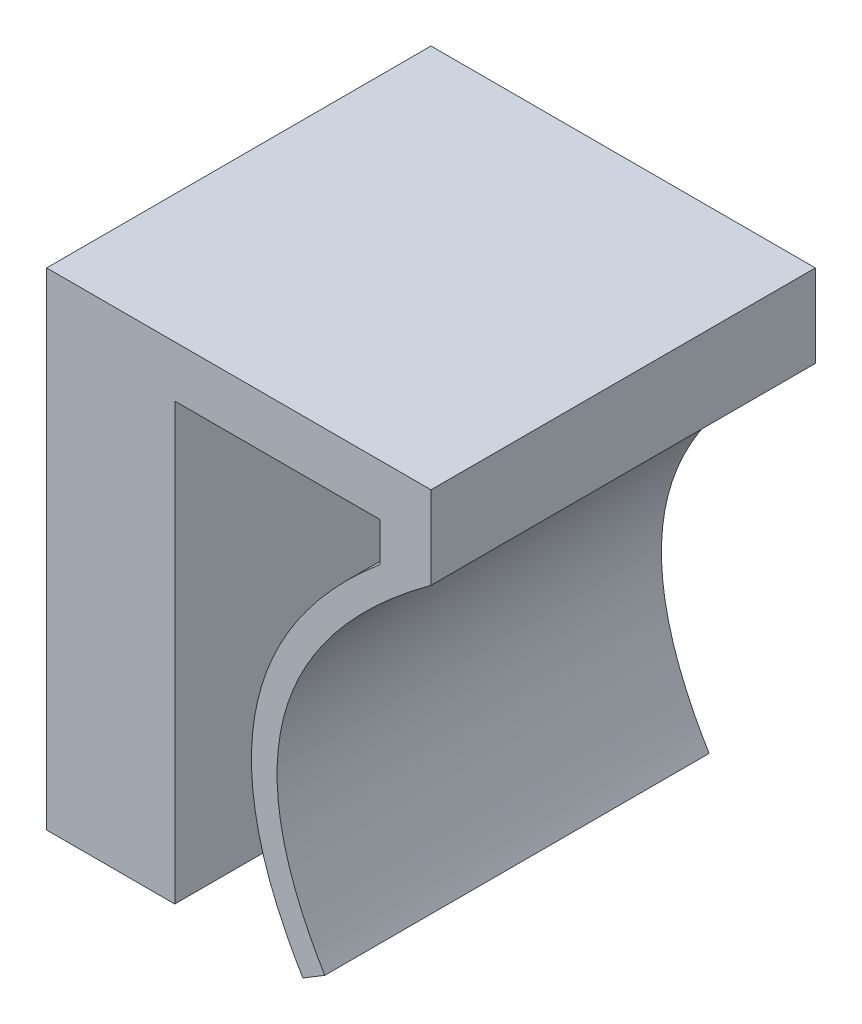
ISO-10303-21;
HEADER;
FILE_DESCRIPTION(('STEP AP214'),'2;1');
FILE_NAME('part.step','',(''),(''),'','','');
FILE_SCHEMA(('AUTOMOTIVE_DESIGN { 1 0 10303 214 1 1 1 1 }'));
ENDSEC;
DATA;
#1=APPLICATION_CONTEXT('core data for automotive mechanical design processes');
#2=APPLICATION_PROTOCOL_DEFINITION('international standard','automotive_design',2000,#1);
#3=PRODUCT_CONTEXT('',#1,'mechanical');
#4=PRODUCT('Part','Part','',(#3));
#5=PRODUCT_RELATED_PRODUCT_CATEGORY('part','',(#4));
#6=PRODUCT_DEFINITION_FORMATION('','',#4);
#7=PRODUCT_DEFINITION_CONTEXT('part definition',#1,'design');
#8=PRODUCT_DEFINITION('design','',#6,#7);
#9=PRODUCT_DEFINITION_SHAPE('','',#8);
#10=(LENGTH_UNIT() NAMED_UNIT(*) SI_UNIT(.MILLI.,.METRE.));
#11=(NAMED_UNIT(*) PLANE_ANGLE_UNIT() SI_UNIT($,.RADIAN.));
#12=(NAMED_UNIT(*) SI_UNIT($,.STERADIAN.) SOLID_ANGLE_UNIT());
#13=UNCERTAINTY_MEASURE_WITH_UNIT(LENGTH_MEASURE(1.E-05),#10,'distance_accuracy_value','');
#14=(GEOMETRIC_REPRESENTATION_CONTEXT(3) GLOBAL_UNCERTAINTY_ASSIGNED_CONTEXT((#13)) GLOBAL_UNIT_ASSIGNED_CONTEXT((#10,
#11,#12)) REPRESENTATION_CONTEXT('',''));
#15=CARTESIAN_POINT('',(0.,0.,0.));
#16=DIRECTION('',(0.,0.,1.));
#17=DIRECTION('',(1.,0.,0.));
#18=AXIS2_PLACEMENT_3D('',#15,#16,#17);
#19=CARTESIAN_POINT('',(9.00000000000061,7.35553860872421E-13,15.));
#20=DIRECTION('',(1.,0.,0.));
#21=DIRECTION('',(0.,1.,0.));
#22=AXIS2_PLACEMENT_3D('',#19,#20,#21);
#23=PLANE('',#22);
#24=DIRECTION('',(0.,-1.,0.));
#25=VECTOR('',#24,1.);
#26=CARTESIAN_POINT('',(9.00000000000061,7.35553860872421E-13,0.));
#27=LINE('',#26,#25);
#28=CARTESIAN_POINT('',(9.,7.5,0.));
#29=VERTEX_POINT('',#28);
#30=CARTESIAN_POINT('',(9.00000000000018,5.97176274610299,0.));
#31=VERTEX_POINT('',#30);
#32=EDGE_CURVE('E182',#29,#31,#27,.T.);
#33=ORIENTED_EDGE('',*,*,#32,.T.);
#34=DIRECTION('',(0.,0.,-1.));
#35=VECTOR('',#34,1.);
#36=CARTESIAN_POINT('',(9.00000000000018,5.97176274610299,15.));
#37=LINE('',#36,#35);
#38=CARTESIAN_POINT('',(9.00000000000018,5.97176274610299,15.));
#39=VERTEX_POINT('',#38);
#40=EDGE_CURVE('E44',#39,#31,#37,.T.);
#41=ORIENTED_EDGE('',*,*,#40,.F.);
#42=DIRECTION('',(0.,-1.,0.));
#43=VECTOR('',#42,1.);
#44=CARTESIAN_POINT('',(9.00000000000061,7.35553860872421E-13,15.));
#45=LINE('',#44,#43);
#46=CARTESIAN_POINT('',(9.,7.5,15.));
#47=VERTEX_POINT('',#46);
#48=EDGE_CURVE('E183',#47,#39,#45,.T.);
#49=ORIENTED_EDGE('',*,*,#48,.F.);
#50=DIRECTION('',(0.,0.,-1.));
#51=VECTOR('',#50,1.);
#52=CARTESIAN_POINT('',(9.,7.5,15.));
#53=LINE('',#52,#51);
#54=EDGE_CURVE('E231',#47,#29,#53,.T.);
#55=ORIENTED_EDGE('',*,*,#54,.T.);
#56=EDGE_LOOP('',(#33,#41,#49,#55));
#57=FACE_BOUND('',#56,.T.);
#58=ADVANCED_FACE('F36',(#57),#23,.F.);
#59=CARTESIAN_POINT('',(11.,7.5,15.));
#60=CARTESIAN_POINT('',(0.240697811936844,0.0167665630268218,15.));
#61=CARTESIAN_POINT('',(6.,-9.5,15.));
#62=B_SPLINE_CURVE_WITH_KNOTS('',2,(#59,#60,#61),.UNSPECIFIED.,.F.,.F.,(3,3),(0.,1.),.UNSPECIFIED.);
#63=DIRECTION('',(0.,0.,-1.));
#64=VECTOR('',#63,1.);
#65=SURFACE_OF_LINEAR_EXTRUSION('',#62,#64);
#66=CARTESIAN_POINT('',(11.,7.5,0.));
#67=CARTESIAN_POINT('',(0.240697811936844,0.0167665630268218,0.));
#68=CARTESIAN_POINT('',(6.,-9.5,0.));
#69=B_SPLINE_CURVE_WITH_KNOTS('',2,(#66,#67,#68),.UNSPECIFIED.,.F.,.F.,(3,3),(0.,1.),.UNSPECIFIED.);
#70=CARTESIAN_POINT('',(6.,-9.5,0.));
#71=VERTEX_POINT('',#70);
#72=EDGE_CURVE('E234',#31,#71,#69,.T.);
#73=ORIENTED_EDGE('',*,*,#72,.T.);
#74=DIRECTION('',(0.,0.,-1.));
#75=VECTOR('',#74,1.);
#76=CARTESIAN_POINT('',(6.,-9.5,15.));
#77=LINE('',#76,#75);
#78=CARTESIAN_POINT('',(6.,-9.5,15.));
#79=VERTEX_POINT('',#78);
#80=EDGE_CURVE('E278',#79,#71,#77,.T.);
#81=ORIENTED_EDGE('',*,*,#80,.F.);
#82=EDGE_CURVE('E186',#39,#79,#62,.T.);
#83=ORIENTED_EDGE('',*,*,#82,.F.);
#84=ORIENTED_EDGE('',*,*,#40,.T.);
#85=EDGE_LOOP('',(#73,#81,#83,#84));
#86=FACE_BOUND('',#85,.T.);
#87=ADVANCED_FACE('F197',(#86),#65,.F.);
#88=CARTESIAN_POINT('',(5.81639736848161,-9.61111158715883,15.));
#89=DIRECTION('',(0.517747016727039,-0.855533767112819,0.));
#90=DIRECTION('',(0.855533767112819,0.517747016727039,0.));
#91=AXIS2_PLACEMENT_3D('',#88,#89,#90);
#92=PLANE('',#91);
#93=DIRECTION('',(-0.855533767112819,-0.517747016727039,0.));
#94=VECTOR('',#93,1.);
#95=CARTESIAN_POINT('',(5.81639736848161,-9.61111158715883,0.));
#96=LINE('',#95,#94);
#97=CARTESIAN_POINT('',(6.85553376711282,-8.98225298327296,0.));
#98=VERTEX_POINT('',#97);
#99=EDGE_CURVE('E239',#98,#71,#96,.T.);
#100=ORIENTED_EDGE('',*,*,#99,.F.);
#101=DIRECTION('',(0.,0.,-1.));
#102=VECTOR('',#101,1.);
#103=CARTESIAN_POINT('',(6.85553376711282,-8.98225298327296,15.));
#104=LINE('',#103,#102);
#105=CARTESIAN_POINT('',(6.85553376711282,-8.98225298327296,15.));
#106=VERTEX_POINT('',#105);
#107=EDGE_CURVE('E276',#106,#98,#104,.T.);
#108=ORIENTED_EDGE('',*,*,#107,.F.);
#109=DIRECTION('',(-0.855533767112819,-0.517747016727039,0.));
#110=VECTOR('',#109,1.);
#111=CARTESIAN_POINT('',(5.81639736848161,-9.61111158715883,15.));
#112=LINE('',#111,#110);
#113=EDGE_CURVE('E192',#106,#79,#112,.T.);
#114=ORIENTED_EDGE('',*,*,#113,.T.);
#115=ORIENTED_EDGE('',*,*,#80,.T.);
#116=EDGE_LOOP('',(#100,#108,#114,#115));
#117=FACE_BOUND('',#116,.T.);
#118=ADVANCED_FACE('F200',(#117),#92,.T.);
#119=CARTESIAN_POINT('',(11.5708639442668,6.67921971086254,15.));
#120=CARTESIAN_POINT('',(11.1510322664102,6.38721490070189,15.));
#121=CARTESIAN_POINT('',(10.3072963332705,5.76628216768855,15.));
#122=CARTESIAN_POINT('',(8.84701885958429,4.54796863746397,15.));
#123=CARTESIAN_POINT('',(7.33459185275467,2.99484609067048,15.));
#124=CARTESIAN_POINT('',(6.04583115905915,1.11952073827862,15.));
#125=CARTESIAN_POINT('',(5.25144148934693,-0.76880077957946,15.));
#126=CARTESIAN_POINT('',(4.92610254372579,-2.68670336514474,15.));
#127=CARTESIAN_POINT('',(5.05697802427731,-4.67242782670206,15.));
#128=CARTESIAN_POINT('',(5.56480484112675,-6.41846130849039,15.));
#129=CARTESIAN_POINT('',(6.21321611618723,-7.85857634427404,15.));
#130=CARTESIAN_POINT('',(6.6357594951209,-8.61910283396404,15.));
#131=CARTESIAN_POINT('',(6.85553376711284,-8.98225298327293,15.));
#132=B_SPLINE_CURVE_WITH_KNOTS('',3,(#119,#120,#121,#122,#123,#124,#125,#126,#127,#128,#129,
#130,#131),.UNSPECIFIED.,.F.,.F.,(4,1,1,1,1,1,1,1,1,1,4),(0.,0.0625,0.125,0.25,0.375,0.5,0.625,
0.75,0.875,0.9375,1.),.UNSPECIFIED.);
#133=DIRECTION('',(0.,0.,-1.));
#134=VECTOR('',#133,1.);
#135=SURFACE_OF_LINEAR_EXTRUSION('',#132,#134);
#136=CARTESIAN_POINT('',(11.5708639442668,6.67921971086254,0.));
#137=CARTESIAN_POINT('',(11.1510322664102,6.38721490070189,0.));
#138=CARTESIAN_POINT('',(10.3072963332705,5.76628216768855,0.));
#139=CARTESIAN_POINT('',(8.84701885958429,4.54796863746397,0.));
#140=CARTESIAN_POINT('',(7.33459185275467,2.99484609067048,0.));
#141=CARTESIAN_POINT('',(6.04583115905915,1.11952073827862,0.));
#142=CARTESIAN_POINT('',(5.25144148934693,-0.76880077957946,0.));
#143=CARTESIAN_POINT('',(4.92610254372579,-2.68670336514474,0.));
#144=CARTESIAN_POINT('',(5.05697802427731,-4.67242782670206,0.));
#145=CARTESIAN_POINT('',(5.56480484112675,-6.41846130849039,0.));
#146=CARTESIAN_POINT('',(6.21321611618723,-7.85857634427404,0.));
#147=CARTESIAN_POINT('',(6.6357594951209,-8.61910283396404,0.));
#148=CARTESIAN_POINT('',(6.85553376711284,-8.98225298327293,0.));
#149=B_SPLINE_CURVE_WITH_KNOTS('',3,(#136,#137,#138,#139,#140,#141,#142,#143,#144,#145,#146,
#147,#148),.UNSPECIFIED.,.F.,.F.,(4,1,1,1,1,1,1,1,1,1,4),(0.,0.0625,0.125,0.25,0.375,0.5,0.625,
0.75,0.875,0.9375,1.),.UNSPECIFIED.);
#150=CARTESIAN_POINT('',(11.,6.27162607439287,0.));
#151=VERTEX_POINT('',#150);
#152=EDGE_CURVE('E245',#151,#98,#149,.T.);
#153=ORIENTED_EDGE('',*,*,#152,.F.);
#154=DIRECTION('',(0.,0.,-1.));
#155=VECTOR('',#154,1.);
#156=CARTESIAN_POINT('',(11.,6.27162607439287,15.));
#157=LINE('',#156,#155);
#158=CARTESIAN_POINT('',(11.,6.27162607439287,15.));
#159=VERTEX_POINT('',#158);
#160=EDGE_CURVE('E274',#159,#151,#157,.T.);
#161=ORIENTED_EDGE('',*,*,#160,.F.);
#162=EDGE_CURVE('E211',#159,#106,#132,.T.);
#163=ORIENTED_EDGE('',*,*,#162,.T.);
#164=ORIENTED_EDGE('',*,*,#107,.T.);
#165=EDGE_LOOP('',(#153,#161,#163,#164));
#166=FACE_BOUND('',#165,.T.);
#167=ADVANCED_FACE('F204',(#166),#135,.T.);
#168=CARTESIAN_POINT('',(11.,0.,15.));
#169=DIRECTION('',(1.,0.,0.));
#170=DIRECTION('',(0.,1.,0.));
#171=AXIS2_PLACEMENT_3D('',#168,#169,#170);
#172=PLANE('',#171);
#173=DIRECTION('',(0.,-1.,0.));
#174=VECTOR('',#173,1.);
#175=CARTESIAN_POINT('',(11.,0.,0.));
#176=LINE('',#175,#174);
#177=CARTESIAN_POINT('',(11.,9.5,0.));
#178=VERTEX_POINT('',#177);
#179=EDGE_CURVE('E250',#178,#151,#176,.T.);
#180=ORIENTED_EDGE('',*,*,#179,.F.);
#181=DIRECTION('',(0.,0.,-1.));
#182=VECTOR('',#181,1.);
#183=CARTESIAN_POINT('',(11.,9.5,15.));
#184=LINE('',#183,#182);
#185=CARTESIAN_POINT('',(11.,9.5,15.));
#186=VERTEX_POINT('',#185);
#187=EDGE_CURVE('E271',#186,#178,#184,.T.);
#188=ORIENTED_EDGE('',*,*,#187,.F.);
#189=DIRECTION('',(0.,-1.,0.));
#190=VECTOR('',#189,1.);
#191=CARTESIAN_POINT('',(11.,0.,15.));
#192=LINE('',#191,#190);
#193=EDGE_CURVE('E217',#186,#159,#192,.T.);
#194=ORIENTED_EDGE('',*,*,#193,.T.);
#195=ORIENTED_EDGE('',*,*,#160,.T.);
#196=EDGE_LOOP('',(#180,#188,#194,#195));
#197=FACE_BOUND('',#196,.T.);
#198=ADVANCED_FACE('F208',(#197),#172,.T.);
#199=CARTESIAN_POINT('',(0.,9.5,15.));
#200=DIRECTION('',(0.,1.,0.));
#201=DIRECTION('',(0.,0.,1.));
#202=AXIS2_PLACEMENT_3D('',#199,#200,#201);
#203=PLANE('',#202);
#204=DIRECTION('',(1.,0.,0.));
#205=VECTOR('',#204,1.);
#206=CARTESIAN_POINT('',(0.,9.5,15.));
#207=LINE('',#206,#205);
#208=CARTESIAN_POINT('',(-4.,9.5,15.));
#209=VERTEX_POINT('',#208);
#210=EDGE_CURVE('E223',#209,#186,#207,.T.);
#211=ORIENTED_EDGE('',*,*,#210,.T.);
#212=ORIENTED_EDGE('',*,*,#187,.T.);
#213=DIRECTION('',(1.,0.,0.));
#214=VECTOR('',#213,1.);
#215=CARTESIAN_POINT('',(0.,9.5,0.));
#216=LINE('',#215,#214);
#217=CARTESIAN_POINT('',(-4.,9.5,0.));
#218=VERTEX_POINT('',#217);
#219=EDGE_CURVE('E256',#218,#178,#216,.T.);
#220=ORIENTED_EDGE('',*,*,#219,.F.);
#221=DIRECTION('',(0.,0.,-1.));
#222=VECTOR('',#221,1.);
#223=CARTESIAN_POINT('',(-4.,9.5,15.));
#224=LINE('',#223,#222);
#225=EDGE_CURVE('E167',#209,#218,#224,.T.);
#226=ORIENTED_EDGE('',*,*,#225,.F.);
#227=EDGE_LOOP('',(#211,#212,#220,#226));
#228=FACE_BOUND('',#227,.T.);
#229=ADVANCED_FACE('F307',(#228),#203,.T.);
#230=CARTESIAN_POINT('',(0.,-9.5,15.));
#231=DIRECTION('',(0.,1.,0.));
#232=DIRECTION('',(0.,0.,1.));
#233=AXIS2_PLACEMENT_3D('',#230,#231,#232);
#234=PLANE('',#233);
#235=DIRECTION('',(1.,0.,0.));
#236=VECTOR('',#235,1.);
#237=CARTESIAN_POINT('',(0.,-9.5,0.));
#238=LINE('',#237,#236);
#239=CARTESIAN_POINT('',(-4.,-9.5,0.));
#240=VERTEX_POINT('',#239);
#241=CARTESIAN_POINT('',(1.,-9.5,0.));
#242=VERTEX_POINT('',#241);
#243=EDGE_CURVE('E258',#240,#242,#238,.T.);
#244=ORIENTED_EDGE('',*,*,#243,.T.);
#245=DIRECTION('',(0.,0.,-1.));
#246=VECTOR('',#245,1.);
#247=CARTESIAN_POINT('',(1.,-9.5,15.));
#248=LINE('',#247,#246);
#249=CARTESIAN_POINT('',(1.,-9.5,15.));
#250=VERTEX_POINT('',#249);
#251=EDGE_CURVE('E268',#250,#242,#248,.T.);
#252=ORIENTED_EDGE('',*,*,#251,.F.);
#253=DIRECTION('',(1.,0.,0.));
#254=VECTOR('',#253,1.);
#255=CARTESIAN_POINT('',(0.,-9.5,15.));
#256=LINE('',#255,#254);
#257=CARTESIAN_POINT('',(-4.,-9.5,15.));
#258=VERTEX_POINT('',#257);
#259=EDGE_CURVE('E225',#258,#250,#256,.T.);
#260=ORIENTED_EDGE('',*,*,#259,.F.);
#261=DIRECTION('',(0.,0.,1.));
#262=VECTOR('',#261,1.);
#263=CARTESIAN_POINT('',(-4.,-9.5,0.));
#264=LINE('',#263,#262);
#265=EDGE_CURVE('E176',#240,#258,#264,.T.);
#266=ORIENTED_EDGE('',*,*,#265,.F.);
#267=EDGE_LOOP('',(#244,#252,#260,#266));
#268=FACE_BOUND('',#267,.T.);
#269=ADVANCED_FACE('F310',(#268),#234,.F.);
#270=CARTESIAN_POINT('',(1.,0.,15.));
#271=DIRECTION('',(-1.,0.,0.));
#272=DIRECTION('',(0.,-1.,0.));
#273=AXIS2_PLACEMENT_3D('',#270,#271,#272);
#274=PLANE('',#273);
#275=DIRECTION('',(0.,1.,0.));
#276=VECTOR('',#275,1.);
#277=CARTESIAN_POINT('',(1.,0.,0.));
#278=LINE('',#277,#276);
#279=CARTESIAN_POINT('',(1.,7.5,0.));
#280=VERTEX_POINT('',#279);
#281=EDGE_CURVE('E260',#242,#280,#278,.T.);
#282=ORIENTED_EDGE('',*,*,#281,.T.);
#283=DIRECTION('',(0.,0.,-1.));
#284=VECTOR('',#283,1.);
#285=CARTESIAN_POINT('',(1.,7.5,15.));
#286=LINE('',#285,#284);
#287=CARTESIAN_POINT('',(1.,7.5,15.));
#288=VERTEX_POINT('',#287);
#289=EDGE_CURVE('E265',#288,#280,#286,.T.);
#290=ORIENTED_EDGE('',*,*,#289,.F.);
#291=DIRECTION('',(0.,1.,0.));
#292=VECTOR('',#291,1.);
#293=CARTESIAN_POINT('',(1.,0.,15.));
#294=LINE('',#293,#292);
#295=EDGE_CURVE('E227',#250,#288,#294,.T.);
#296=ORIENTED_EDGE('',*,*,#295,.F.);
#297=ORIENTED_EDGE('',*,*,#251,.T.);
#298=EDGE_LOOP('',(#282,#290,#296,#297));
#299=FACE_BOUND('',#298,.T.);
#300=ADVANCED_FACE('F316',(#299),#274,.F.);
#301=CARTESIAN_POINT('',(0.,7.5,15.));
#302=DIRECTION('',(0.,1.,0.));
#303=DIRECTION('',(0.,0.,1.));
#304=AXIS2_PLACEMENT_3D('',#301,#302,#303);
#305=PLANE('',#304);
#306=DIRECTION('',(1.,0.,0.));
#307=VECTOR('',#306,1.);
#308=CARTESIAN_POINT('',(0.,7.5,0.));
#309=LINE('',#308,#307);
#310=EDGE_CURVE('E187',#280,#29,#309,.T.);
#311=ORIENTED_EDGE('',*,*,#310,.T.);
#312=ORIENTED_EDGE('',*,*,#54,.F.);
#313=DIRECTION('',(1.,0.,0.));
#314=VECTOR('',#313,1.);
#315=CARTESIAN_POINT('',(0.,7.5,15.));
#316=LINE('',#315,#314);
#317=EDGE_CURVE('E229',#288,#47,#316,.T.);
#318=ORIENTED_EDGE('',*,*,#317,.F.);
#319=ORIENTED_EDGE('',*,*,#289,.T.);
#320=EDGE_LOOP('',(#311,#312,#318,#319));
#321=FACE_BOUND('',#320,.T.);
#322=ADVANCED_FACE('F318',(#321),#305,.F.);
#323=CARTESIAN_POINT('',(0.,0.,15.));
#324=DIRECTION('',(0.,0.,1.));
#325=DIRECTION('',(1.,0.,0.));
#326=AXIS2_PLACEMENT_3D('',#323,#324,#325);
#327=PLANE('',#326);
#328=ORIENTED_EDGE('',*,*,#259,.T.);
#329=ORIENTED_EDGE('',*,*,#295,.T.);
#330=ORIENTED_EDGE('',*,*,#317,.T.);
#331=ORIENTED_EDGE('',*,*,#48,.T.);
#332=ORIENTED_EDGE('',*,*,#82,.T.);
#333=ORIENTED_EDGE('',*,*,#113,.F.);
#334=ORIENTED_EDGE('',*,*,#162,.F.);
#335=ORIENTED_EDGE('',*,*,#193,.F.);
#336=ORIENTED_EDGE('',*,*,#210,.F.);
#337=DIRECTION('',(0.,1.,0.));
#338=VECTOR('',#337,1.);
#339=CARTESIAN_POINT('',(-4.,-9.5,15.));
#340=LINE('',#339,#338);
#341=EDGE_CURVE('E179',#258,#209,#340,.T.);
#342=ORIENTED_EDGE('',*,*,#341,.F.);
#343=EDGE_LOOP('',(#328,#329,#330,#331,#332,#333,#334,#335,#336,#342));
#344=FACE_BOUND('',#343,.T.);
#345=ADVANCED_FACE('F296',(#344),#327,.T.);
#346=CARTESIAN_POINT('',(0.,0.,0.));
#347=DIRECTION('',(0.,0.,1.));
#348=DIRECTION('',(1.,0.,0.));
#349=AXIS2_PLACEMENT_3D('',#346,#347,#348);
#350=PLANE('',#349);
#351=ORIENTED_EDGE('',*,*,#219,.T.);
#352=ORIENTED_EDGE('',*,*,#179,.T.);
#353=ORIENTED_EDGE('',*,*,#152,.T.);
#354=ORIENTED_EDGE('',*,*,#99,.T.);
#355=ORIENTED_EDGE('',*,*,#72,.F.);
#356=ORIENTED_EDGE('',*,*,#32,.F.);
#357=ORIENTED_EDGE('',*,*,#310,.F.);
#358=ORIENTED_EDGE('',*,*,#281,.F.);
#359=ORIENTED_EDGE('',*,*,#243,.F.);
#360=DIRECTION('',(0.,-1.,0.));
#361=VECTOR('',#360,1.);
#362=CARTESIAN_POINT('',(-4.,9.5,0.));
#363=LINE('',#362,#361);
#364=EDGE_CURVE('E173',#218,#240,#363,.T.);
#365=ORIENTED_EDGE('',*,*,#364,.F.);
#366=EDGE_LOOP('',(#351,#352,#353,#354,#355,#356,#357,#358,#359,#365));
#367=FACE_BOUND('',#366,.T.);
#368=ADVANCED_FACE('F288',(#367),#350,.F.);
#369=CARTESIAN_POINT('',(-4.,0.,0.));
#370=DIRECTION('',(-1.,0.,0.));
#371=DIRECTION('',(0.,0.,1.));
#372=AXIS2_PLACEMENT_3D('',#369,#370,#371);
#373=PLANE('',#372);
#374=ORIENTED_EDGE('',*,*,#225,.T.);
#375=ORIENTED_EDGE('',*,*,#364,.T.);
#376=ORIENTED_EDGE('',*,*,#265,.T.);
#377=ORIENTED_EDGE('',*,*,#341,.T.);
#378=EDGE_LOOP('',(#374,#375,#376,#377));
#379=FACE_BOUND('',#378,.T.);
#380=ADVANCED_FACE('F305',(#379),#373,.T.);
#381=CLOSED_SHELL('',(#58,#87,#118,#167,#198,#229,#269,#300,#322,#345,#368,#380));
#382=CARTESIAN_POINT('',(-3.5,0.,0.));
#383=DIRECTION('',(-1.,0.,0.));
#384=DIRECTION('',(0.,0.,1.));
#385=AXIS2_PLACEMENT_3D('',#382,#383,#384);
#386=PLANE('',#385);
#387=DIRECTION('',(0.,-1.,0.));
#388=VECTOR('',#387,1.);
#389=CARTESIAN_POINT('',(-3.5,-0.5,10.75));
#390=LINE('',#389,#388);
#391=CARTESIAN_POINT('',(-3.5,1.,10.75));
#392=VERTEX_POINT('',#391);
#393=CARTESIAN_POINT('',(-3.5,-0.5,10.75));
#394=VERTEX_POINT('',#393);
#395=EDGE_CURVE('E11',#392,#394,#390,.T.);
#396=ORIENTED_EDGE('',*,*,#395,.T.);
#397=CARTESIAN_POINT('',(-3.5,-0.5,7.5));
#398=DIRECTION('',(-1.,0.,0.));
#399=DIRECTION('',(0.,0.,1.));
#400=AXIS2_PLACEMENT_3D('',#397,#398,#399);
#401=CIRCLE('',#400,3.25);
#402=CARTESIAN_POINT('',(-3.5,-0.5,4.25));
#403=VERTEX_POINT('',#402);
#404=EDGE_CURVE('E149',#394,#403,#401,.F.);
#405=ORIENTED_EDGE('',*,*,#404,.T.);
#406=DIRECTION('',(0.,1.,0.));
#407=VECTOR('',#406,1.);
#408=CARTESIAN_POINT('',(-3.5,-0.5,4.25));
#409=LINE('',#408,#407);
#410=CARTESIAN_POINT('',(-3.5,1.,4.25));
#411=VERTEX_POINT('',#410);
#412=EDGE_CURVE('E51',#403,#411,#409,.T.);
#413=ORIENTED_EDGE('',*,*,#412,.T.);
#414=CARTESIAN_POINT('',(-3.5,1.,7.5));
#415=DIRECTION('',(-1.,0.,0.));
#416=DIRECTION('',(0.,0.,1.));
#417=AXIS2_PLACEMENT_3D('',#414,#415,#416);
#418=CIRCLE('',#417,3.25);
#419=EDGE_CURVE('E59',#411,#392,#418,.F.);
#420=ORIENTED_EDGE('',*,*,#419,.T.);
#421=EDGE_LOOP('',(#396,#405,#413,#420));
#422=FACE_BOUND('',#421,.T.);
#423=ADVANCED_FACE('F155',(#422),#386,.F.);
#424=CARTESIAN_POINT('',(-2.,-0.5,7.5));
#425=DIRECTION('',(-1.,0.,0.));
#426=DIRECTION('',(0.,0.,1.));
#427=AXIS2_PLACEMENT_3D('',#424,#425,#426);
#428=PLANE('',#427);
#429=CARTESIAN_POINT('',(-2.,-0.5,7.5));
#430=DIRECTION('',(-1.,0.,0.));
#431=DIRECTION('',(0.,0.,1.));
#432=AXIS2_PLACEMENT_3D('',#429,#430,#431);
#433=CIRCLE('',#432,3.25);
#434=CARTESIAN_POINT('',(-2.,-0.5,4.25));
#435=VERTEX_POINT('',#434);
#436=CARTESIAN_POINT('',(-2.,-0.5,10.75));
#437=VERTEX_POINT('',#436);
#438=EDGE_CURVE('E153',#435,#437,#433,.T.);
#439=ORIENTED_EDGE('',*,*,#438,.T.);
#440=DIRECTION('',(0.,1.,0.));
#441=VECTOR('',#440,1.);
#442=CARTESIAN_POINT('',(-2.,-0.5,10.75));
#443=LINE('',#442,#441);
#444=CARTESIAN_POINT('',(-2.,1.,10.75));
#445=VERTEX_POINT('',#444);
#446=EDGE_CURVE('E141',#437,#445,#443,.T.);
#447=ORIENTED_EDGE('',*,*,#446,.T.);
#448=CARTESIAN_POINT('',(-2.,1.,7.5));
#449=DIRECTION('',(-1.,0.,0.));
#450=DIRECTION('',(0.,0.,1.));
#451=AXIS2_PLACEMENT_3D('',#448,#449,#450);
#452=CIRCLE('',#451,3.25);
#453=CARTESIAN_POINT('',(-2.,1.,4.25));
#454=VERTEX_POINT('',#453);
#455=EDGE_CURVE('E161',#445,#454,#452,.T.);
#456=ORIENTED_EDGE('',*,*,#455,.T.);
#457=DIRECTION('',(0.,-1.,0.));
#458=VECTOR('',#457,1.);
#459=CARTESIAN_POINT('',(-2.,-0.5,4.25));
#460=LINE('',#459,#458);
#461=EDGE_CURVE('E146',#454,#435,#460,.T.);
#462=ORIENTED_EDGE('',*,*,#461,.T.);
#463=EDGE_LOOP('',(#439,#447,#456,#462));
#464=FACE_BOUND('',#463,.T.);
#465=ADVANCED_FACE('F375',(#464),#428,.T.);
#466=CARTESIAN_POINT('',(-2.,-0.5,10.75));
#467=DIRECTION('',(0.,0.,1.));
#468=DIRECTION('',(1.,0.,0.));
#469=AXIS2_PLACEMENT_3D('',#466,#467,#468);
#470=PLANE('',#469);
#471=ORIENTED_EDGE('',*,*,#395,.F.);
#472=DIRECTION('',(-1.,0.,0.));
#473=VECTOR('',#472,1.);
#474=CARTESIAN_POINT('',(-2.,1.,10.75));
#475=LINE('',#474,#473);
#476=EDGE_CURVE('E145',#445,#392,#475,.T.);
#477=ORIENTED_EDGE('',*,*,#476,.F.);
#478=ORIENTED_EDGE('',*,*,#446,.F.);
#479=DIRECTION('',(-1.,0.,0.));
#480=VECTOR('',#479,1.);
#481=CARTESIAN_POINT('',(-2.,-0.5,10.75));
#482=LINE('',#481,#480);
#483=EDGE_CURVE('E137',#437,#394,#482,.T.);
#484=ORIENTED_EDGE('',*,*,#483,.T.);
#485=EDGE_LOOP('',(#471,#477,#478,#484));
#486=FACE_BOUND('',#485,.T.);
#487=ADVANCED_FACE('F139',(#486),#470,.F.);
#488=CARTESIAN_POINT('',(-2.,1.,7.5));
#489=DIRECTION('',(-1.,0.,0.));
#490=DIRECTION('',(0.,0.,1.));
#491=AXIS2_PLACEMENT_3D('',#488,#489,#490);
#492=CYLINDRICAL_SURFACE('',#491,3.25);
#493=ORIENTED_EDGE('',*,*,#419,.F.);
#494=DIRECTION('',(-1.,0.,0.));
#495=VECTOR('',#494,1.);
#496=CARTESIAN_POINT('',(-2.,1.,4.25));
#497=LINE('',#496,#495);
#498=EDGE_CURVE('E168',#454,#411,#497,.T.);
#499=ORIENTED_EDGE('',*,*,#498,.F.);
#500=ORIENTED_EDGE('',*,*,#455,.F.);
#501=ORIENTED_EDGE('',*,*,#476,.T.);
#502=EDGE_LOOP('',(#493,#499,#500,#501));
#503=FACE_BOUND('',#502,.T.);
#504=ADVANCED_FACE('F395',(#503),#492,.F.);
#505=CARTESIAN_POINT('',(-2.,-0.5,4.25));
#506=DIRECTION('',(0.,0.,-1.));
#507=DIRECTION('',(-1.,0.,0.));
#508=AXIS2_PLACEMENT_3D('',#505,#506,#507);
#509=PLANE('',#508);
#510=ORIENTED_EDGE('',*,*,#412,.F.);
#511=DIRECTION('',(-1.,0.,0.));
#512=VECTOR('',#511,1.);
#513=CARTESIAN_POINT('',(-2.,-0.5,4.25));
#514=LINE('',#513,#512);
#515=EDGE_CURVE('E151',#435,#403,#514,.T.);
#516=ORIENTED_EDGE('',*,*,#515,.F.);
#517=ORIENTED_EDGE('',*,*,#461,.F.);
#518=ORIENTED_EDGE('',*,*,#498,.T.);
#519=EDGE_LOOP('',(#510,#516,#517,#518));
#520=FACE_BOUND('',#519,.T.);
#521=ADVANCED_FACE('F401',(#520),#509,.F.);
#522=CARTESIAN_POINT('',(-2.,-0.5,7.5));
#523=DIRECTION('',(-1.,0.,0.));
#524=DIRECTION('',(0.,0.,1.));
#525=AXIS2_PLACEMENT_3D('',#522,#523,#524);
#526=CYLINDRICAL_SURFACE('',#525,3.25);
#527=ORIENTED_EDGE('',*,*,#404,.F.);
#528=ORIENTED_EDGE('',*,*,#483,.F.);
#529=ORIENTED_EDGE('',*,*,#438,.F.);
#530=ORIENTED_EDGE('',*,*,#515,.T.);
#531=EDGE_LOOP('',(#527,#528,#529,#530));
#532=FACE_BOUND('',#531,.T.);
#533=ADVANCED_FACE('F150',(#532),#526,.F.);
#534=CLOSED_SHELL('',(#423,#465,#487,#504,#521,#533));
#535=ORIENTED_CLOSED_SHELL('',*,#534,.T.);
#536=BREP_WITH_VOIDS('B2',#381,(#535));
#537=ADVANCED_BREP_SHAPE_REPRESENTATION('',(#18,#536),#14);
#538=SHAPE_DEFINITION_REPRESENTATION(#9,#537);
ENDSEC;
END-ISO-10303-21;
